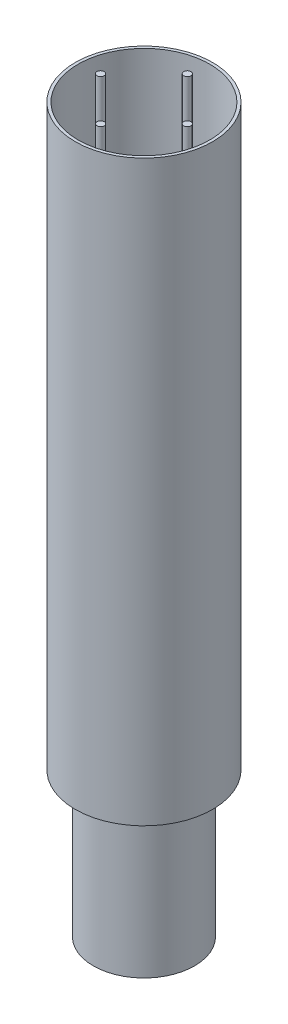
ISO-10303-21;
HEADER;
FILE_DESCRIPTION(('STEP AP214'),'2;1');
FILE_NAME('part.step','',(''),(''),'','','');
FILE_SCHEMA(('AUTOMOTIVE_DESIGN { 1 0 10303 214 1 1 1 1 }'));
ENDSEC;
DATA;
#1=APPLICATION_CONTEXT('core data for automotive mechanical design processes');
#2=APPLICATION_PROTOCOL_DEFINITION('international standard','automotive_design',2000,#1);
#3=PRODUCT_CONTEXT('',#1,'mechanical');
#4=PRODUCT('Part','Part','',(#3));
#5=PRODUCT_RELATED_PRODUCT_CATEGORY('part','',(#4));
#6=PRODUCT_DEFINITION_FORMATION('','',#4);
#7=PRODUCT_DEFINITION_CONTEXT('part definition',#1,'design');
#8=PRODUCT_DEFINITION('design','',#6,#7);
#9=PRODUCT_DEFINITION_SHAPE('','',#8);
#10=(LENGTH_UNIT() NAMED_UNIT(*) SI_UNIT(.MILLI.,.METRE.));
#11=(NAMED_UNIT(*) PLANE_ANGLE_UNIT() SI_UNIT($,.RADIAN.));
#12=(NAMED_UNIT(*) SI_UNIT($,.STERADIAN.) SOLID_ANGLE_UNIT());
#13=UNCERTAINTY_MEASURE_WITH_UNIT(LENGTH_MEASURE(1.E-05),#10,'distance_accuracy_value','');
#14=(GEOMETRIC_REPRESENTATION_CONTEXT(3) GLOBAL_UNCERTAINTY_ASSIGNED_CONTEXT((#13)) GLOBAL_UNIT_ASSIGNED_CONTEXT((#10,
#11,#12)) REPRESENTATION_CONTEXT('',''));
#15=CARTESIAN_POINT('',(0.,0.,0.));
#16=DIRECTION('',(0.,0.,1.));
#17=DIRECTION('',(1.,0.,0.));
#18=AXIS2_PLACEMENT_3D('',#15,#16,#17);
#19=CARTESIAN_POINT('',(0.,502.,30.));
#20=DIRECTION('',(0.,-1.,0.));
#21=DIRECTION('',(0.,0.,-1.));
#22=AXIS2_PLACEMENT_3D('',#19,#20,#21);
#23=CYLINDRICAL_SURFACE('',#22,2.5);
#24=CARTESIAN_POINT('',(0.,502.,30.));
#25=DIRECTION('',(0.,1.,0.));
#26=DIRECTION('',(0.,0.,1.));
#27=AXIS2_PLACEMENT_3D('',#24,#25,#26);
#28=CIRCLE('',#27,2.5);
#29=CARTESIAN_POINT('',(0.,502.,32.5));
#30=VERTEX_POINT('',#29);
#31=EDGE_CURVE('E47',#30,#30,#28,.T.);
#32=ORIENTED_EDGE('',*,*,#31,.F.);
#33=EDGE_LOOP('',(#32));
#34=FACE_BOUND('',#33,.T.);
#35=CARTESIAN_POINT('',(0.,102.,30.));
#36=DIRECTION('',(0.,1.,0.));
#37=DIRECTION('',(0.,0.,1.));
#38=AXIS2_PLACEMENT_3D('',#35,#36,#37);
#39=CIRCLE('',#38,2.5);
#40=CARTESIAN_POINT('',(0.,102.,32.5));
#41=VERTEX_POINT('',#40);
#42=EDGE_CURVE('E11',#41,#41,#39,.T.);
#43=ORIENTED_EDGE('',*,*,#42,.T.);
#44=EDGE_LOOP('',(#43));
#45=FACE_BOUND('',#44,.T.);
#46=ADVANCED_FACE('F43',(#34,#45),#23,.T.);
#47=CARTESIAN_POINT('',(0.,502.,30.));
#48=DIRECTION('',(0.,1.,0.));
#49=DIRECTION('',(0.,0.,1.));
#50=AXIS2_PLACEMENT_3D('',#47,#48,#49);
#51=PLANE('',#50);
#52=ORIENTED_EDGE('',*,*,#31,.T.);
#53=EDGE_LOOP('',(#52));
#54=FACE_BOUND('',#53,.T.);
#55=ADVANCED_FACE('F45',(#54),#51,.T.);
#56=CARTESIAN_POINT('',(0.,102.,30.));
#57=DIRECTION('',(0.,1.,0.));
#58=DIRECTION('',(0.,0.,1.));
#59=AXIS2_PLACEMENT_3D('',#56,#57,#58);
#60=PLANE('',#59);
#61=ORIENTED_EDGE('',*,*,#42,.F.);
#62=EDGE_LOOP('',(#61));
#63=FACE_BOUND('',#62,.T.);
#64=ADVANCED_FACE('F62',(#63),#60,.F.);
#65=CLOSED_SHELL('',(#46,#55,#64));
#66=MANIFOLD_SOLID_BREP('B2',#65);
#67=CARTESIAN_POINT('',(30.,502.,0.));
#68=DIRECTION('',(0.,-1.,0.));
#69=DIRECTION('',(0.,0.,-1.));
#70=AXIS2_PLACEMENT_3D('',#67,#68,#69);
#71=CYLINDRICAL_SURFACE('',#70,2.5);
#72=CARTESIAN_POINT('',(30.,502.,0.));
#73=DIRECTION('',(0.,1.,0.));
#74=DIRECTION('',(0.,0.,1.));
#75=AXIS2_PLACEMENT_3D('',#72,#73,#74);
#76=CIRCLE('',#75,2.5);
#77=CARTESIAN_POINT('',(30.,502.,2.5));
#78=VERTEX_POINT('',#77);
#79=EDGE_CURVE('E101',#78,#78,#76,.T.);
#80=ORIENTED_EDGE('',*,*,#79,.F.);
#81=EDGE_LOOP('',(#80));
#82=FACE_BOUND('',#81,.T.);
#83=CARTESIAN_POINT('',(30.,102.,0.));
#84=DIRECTION('',(0.,1.,0.));
#85=DIRECTION('',(0.,0.,1.));
#86=AXIS2_PLACEMENT_3D('',#83,#84,#85);
#87=CIRCLE('',#86,2.5);
#88=CARTESIAN_POINT('',(30.,102.,2.5));
#89=VERTEX_POINT('',#88);
#90=EDGE_CURVE('E42',#89,#89,#87,.T.);
#91=ORIENTED_EDGE('',*,*,#90,.T.);
#92=EDGE_LOOP('',(#91));
#93=FACE_BOUND('',#92,.T.);
#94=ADVANCED_FACE('F97',(#82,#93),#71,.T.);
#95=CARTESIAN_POINT('',(30.,502.,0.));
#96=DIRECTION('',(0.,1.,0.));
#97=DIRECTION('',(0.,0.,1.));
#98=AXIS2_PLACEMENT_3D('',#95,#96,#97);
#99=PLANE('',#98);
#100=ORIENTED_EDGE('',*,*,#79,.T.);
#101=EDGE_LOOP('',(#100));
#102=FACE_BOUND('',#101,.T.);
#103=ADVANCED_FACE('F99',(#102),#99,.T.);
#104=CARTESIAN_POINT('',(30.,102.,0.));
#105=DIRECTION('',(0.,1.,0.));
#106=DIRECTION('',(0.,0.,1.));
#107=AXIS2_PLACEMENT_3D('',#104,#105,#106);
#108=PLANE('',#107);
#109=ORIENTED_EDGE('',*,*,#90,.F.);
#110=EDGE_LOOP('',(#109));
#111=FACE_BOUND('',#110,.T.);
#112=ADVANCED_FACE('F116',(#111),#108,.F.);
#113=CLOSED_SHELL('',(#94,#103,#112));
#114=MANIFOLD_SOLID_BREP('B6',#113);
#115=CARTESIAN_POINT('',(0.,502.,-30.));
#116=DIRECTION('',(0.,-1.,0.));
#117=DIRECTION('',(0.,0.,-1.));
#118=AXIS2_PLACEMENT_3D('',#115,#116,#117);
#119=CYLINDRICAL_SURFACE('',#118,2.5);
#120=CARTESIAN_POINT('',(0.,502.,-30.));
#121=DIRECTION('',(0.,1.,0.));
#122=DIRECTION('',(0.,0.,1.));
#123=AXIS2_PLACEMENT_3D('',#120,#121,#122);
#124=CIRCLE('',#123,2.5);
#125=CARTESIAN_POINT('',(0.,502.,-27.5));
#126=VERTEX_POINT('',#125);
#127=EDGE_CURVE('E155',#126,#126,#124,.T.);
#128=ORIENTED_EDGE('',*,*,#127,.F.);
#129=EDGE_LOOP('',(#128));
#130=FACE_BOUND('',#129,.T.);
#131=CARTESIAN_POINT('',(0.,102.,-30.));
#132=DIRECTION('',(0.,1.,0.));
#133=DIRECTION('',(0.,0.,1.));
#134=AXIS2_PLACEMENT_3D('',#131,#132,#133);
#135=CIRCLE('',#134,2.5);
#136=CARTESIAN_POINT('',(0.,102.,-27.5));
#137=VERTEX_POINT('',#136);
#138=EDGE_CURVE('E96',#137,#137,#135,.T.);
#139=ORIENTED_EDGE('',*,*,#138,.T.);
#140=EDGE_LOOP('',(#139));
#141=FACE_BOUND('',#140,.T.);
#142=ADVANCED_FACE('F151',(#130,#141),#119,.T.);
#143=CARTESIAN_POINT('',(0.,502.,-30.));
#144=DIRECTION('',(0.,1.,0.));
#145=DIRECTION('',(0.,0.,1.));
#146=AXIS2_PLACEMENT_3D('',#143,#144,#145);
#147=PLANE('',#146);
#148=ORIENTED_EDGE('',*,*,#127,.T.);
#149=EDGE_LOOP('',(#148));
#150=FACE_BOUND('',#149,.T.);
#151=ADVANCED_FACE('F153',(#150),#147,.T.);
#152=CARTESIAN_POINT('',(0.,102.,-30.));
#153=DIRECTION('',(0.,1.,0.));
#154=DIRECTION('',(0.,0.,1.));
#155=AXIS2_PLACEMENT_3D('',#152,#153,#154);
#156=PLANE('',#155);
#157=ORIENTED_EDGE('',*,*,#138,.F.);
#158=EDGE_LOOP('',(#157));
#159=FACE_BOUND('',#158,.T.);
#160=ADVANCED_FACE('F170',(#159),#156,.F.);
#161=CLOSED_SHELL('',(#142,#151,#160));
#162=MANIFOLD_SOLID_BREP('B37',#161);
#163=CARTESIAN_POINT('',(-30.,502.,0.));
#164=DIRECTION('',(0.,-1.,0.));
#165=DIRECTION('',(0.,0.,-1.));
#166=AXIS2_PLACEMENT_3D('',#163,#164,#165);
#167=CYLINDRICAL_SURFACE('',#166,2.5);
#168=CARTESIAN_POINT('',(-30.,502.,0.));
#169=DIRECTION('',(0.,1.,0.));
#170=DIRECTION('',(0.,0.,1.));
#171=AXIS2_PLACEMENT_3D('',#168,#169,#170);
#172=CIRCLE('',#171,2.5);
#173=CARTESIAN_POINT('',(-30.,502.,2.5));
#174=VERTEX_POINT('',#173);
#175=EDGE_CURVE('E150',#174,#174,#172,.T.);
#176=ORIENTED_EDGE('',*,*,#175,.F.);
#177=EDGE_LOOP('',(#176));
#178=FACE_BOUND('',#177,.T.);
#179=CARTESIAN_POINT('',(-30.,102.,0.));
#180=DIRECTION('',(0.,1.,0.));
#181=DIRECTION('',(0.,0.,1.));
#182=AXIS2_PLACEMENT_3D('',#179,#180,#181);
#183=CIRCLE('',#182,2.5);
#184=CARTESIAN_POINT('',(-30.,102.,2.5));
#185=VERTEX_POINT('',#184);
#186=EDGE_CURVE('E207',#185,#185,#183,.T.);
#187=ORIENTED_EDGE('',*,*,#186,.T.);
#188=EDGE_LOOP('',(#187));
#189=FACE_BOUND('',#188,.T.);
#190=ADVANCED_FACE('F204',(#178,#189),#167,.T.);
#191=CARTESIAN_POINT('',(-30.,502.,0.));
#192=DIRECTION('',(0.,1.,0.));
#193=DIRECTION('',(0.,0.,1.));
#194=AXIS2_PLACEMENT_3D('',#191,#192,#193);
#195=PLANE('',#194);
#196=ORIENTED_EDGE('',*,*,#175,.T.);
#197=EDGE_LOOP('',(#196));
#198=FACE_BOUND('',#197,.T.);
#199=ADVANCED_FACE('F219',(#198),#195,.T.);
#200=CARTESIAN_POINT('',(-30.,102.,0.));
#201=DIRECTION('',(0.,1.,0.));
#202=DIRECTION('',(0.,0.,1.));
#203=AXIS2_PLACEMENT_3D('',#200,#201,#202);
#204=PLANE('',#203);
#205=ORIENTED_EDGE('',*,*,#186,.F.);
#206=EDGE_LOOP('',(#205));
#207=FACE_BOUND('',#206,.T.);
#208=ADVANCED_FACE('F217',(#207),#204,.F.);
#209=CLOSED_SHELL('',(#190,#199,#208));
#210=MANIFOLD_SOLID_BREP('B91',#209);
#211=CARTESIAN_POINT('',(0.,100.,0.));
#212=DIRECTION('',(0.,-1.,0.));
#213=DIRECTION('',(0.,0.,-1.));
#214=AXIS2_PLACEMENT_3D('',#211,#212,#213);
#215=CYLINDRICAL_SURFACE('',#214,35.);
#216=CARTESIAN_POINT('',(0.,100.,0.));
#217=DIRECTION('',(0.,1.,0.));
#218=DIRECTION('',(0.,0.,1.));
#219=AXIS2_PLACEMENT_3D('',#216,#217,#218);
#220=CIRCLE('',#219,35.);
#221=CARTESIAN_POINT('',(0.,100.,35.));
#222=VERTEX_POINT('',#221);
#223=EDGE_CURVE('E203',#222,#222,#220,.T.);
#224=ORIENTED_EDGE('',*,*,#223,.F.);
#225=EDGE_LOOP('',(#224));
#226=FACE_BOUND('',#225,.T.);
#227=CARTESIAN_POINT('',(0.,0.,0.));
#228=DIRECTION('',(0.,1.,0.));
#229=DIRECTION('',(0.,0.,1.));
#230=AXIS2_PLACEMENT_3D('',#227,#228,#229);
#231=CIRCLE('',#230,35.);
#232=CARTESIAN_POINT('',(0.,0.,35.));
#233=VERTEX_POINT('',#232);
#234=EDGE_CURVE('E253',#233,#233,#231,.T.);
#235=ORIENTED_EDGE('',*,*,#234,.T.);
#236=EDGE_LOOP('',(#235));
#237=FACE_BOUND('',#236,.T.);
#238=ADVANCED_FACE('F250',(#226,#237),#215,.T.);
#239=CARTESIAN_POINT('',(0.,0.,0.));
#240=DIRECTION('',(0.,1.,0.));
#241=DIRECTION('',(0.,0.,1.));
#242=AXIS2_PLACEMENT_3D('',#239,#240,#241);
#243=PLANE('',#242);
#244=ORIENTED_EDGE('',*,*,#234,.F.);
#245=EDGE_LOOP('',(#244));
#246=FACE_BOUND('',#245,.T.);
#247=ADVANCED_FACE('F300',(#246),#243,.F.);
#248=CARTESIAN_POINT('',(0.,500.,0.));
#249=DIRECTION('',(0.,-1.,0.));
#250=DIRECTION('',(0.,0.,-1.));
#251=AXIS2_PLACEMENT_3D('',#248,#249,#250);
#252=CYLINDRICAL_SURFACE('',#251,47.5000000000001);
#253=CARTESIAN_POINT('',(0.,500.,0.));
#254=DIRECTION('',(0.,1.,0.));
#255=DIRECTION('',(0.,0.,1.));
#256=AXIS2_PLACEMENT_3D('',#253,#254,#255);
#257=CIRCLE('',#256,47.5000000000001);
#258=CARTESIAN_POINT('',(0.,500.,47.5000000000001));
#259=VERTEX_POINT('',#258);
#260=EDGE_CURVE('E260',#259,#259,#257,.T.);
#261=ORIENTED_EDGE('',*,*,#260,.F.);
#262=EDGE_LOOP('',(#261));
#263=FACE_BOUND('',#262,.T.);
#264=CARTESIAN_POINT('',(0.,100.,0.));
#265=DIRECTION('',(0.,1.,0.));
#266=DIRECTION('',(0.,0.,1.));
#267=AXIS2_PLACEMENT_3D('',#264,#265,#266);
#268=CIRCLE('',#267,47.5000000000001);
#269=CARTESIAN_POINT('',(0.,100.,47.5000000000001));
#270=VERTEX_POINT('',#269);
#271=EDGE_CURVE('E262',#270,#270,#268,.T.);
#272=ORIENTED_EDGE('',*,*,#271,.T.);
#273=EDGE_LOOP('',(#272));
#274=FACE_BOUND('',#273,.T.);
#275=ADVANCED_FACE('F305',(#263,#274),#252,.T.);
#276=CARTESIAN_POINT('',(0.,500.,0.));
#277=DIRECTION('',(0.,1.,0.));
#278=DIRECTION('',(0.,0.,1.));
#279=AXIS2_PLACEMENT_3D('',#276,#277,#278);
#280=PLANE('',#279);
#281=CARTESIAN_POINT('',(0.,500.,0.));
#282=DIRECTION('',(0.,1.,0.));
#283=DIRECTION('',(0.,0.,1.));
#284=AXIS2_PLACEMENT_3D('',#281,#282,#283);
#285=CIRCLE('',#284,45.5000000000001);
#286=CARTESIAN_POINT('',(0.,500.,45.5000000000001));
#287=VERTEX_POINT('',#286);
#288=EDGE_CURVE('E268',#287,#287,#285,.T.);
#289=ORIENTED_EDGE('',*,*,#288,.F.);
#290=EDGE_LOOP('',(#289));
#291=FACE_BOUND('',#290,.T.);
#292=ORIENTED_EDGE('',*,*,#260,.T.);
#293=EDGE_LOOP('',(#292));
#294=FACE_BOUND('',#293,.T.);
#295=ADVANCED_FACE('F312',(#291,#294),#280,.T.);
#296=CARTESIAN_POINT('',(0.,100.,0.));
#297=DIRECTION('',(0.,1.,0.));
#298=DIRECTION('',(0.,0.,1.));
#299=AXIS2_PLACEMENT_3D('',#296,#297,#298);
#300=PLANE('',#299);
#301=ORIENTED_EDGE('',*,*,#223,.T.);
#302=EDGE_LOOP('',(#301));
#303=FACE_BOUND('',#302,.T.);
#304=ORIENTED_EDGE('',*,*,#271,.F.);
#305=EDGE_LOOP('',(#304));
#306=FACE_BOUND('',#305,.T.);
#307=ADVANCED_FACE('F316',(#303,#306),#300,.F.);
#308=CARTESIAN_POINT('',(0.,100.,0.));
#309=DIRECTION('',(0.,-1.,0.));
#310=DIRECTION('',(0.,0.,-1.));
#311=AXIS2_PLACEMENT_3D('',#308,#309,#310);
#312=CYLINDRICAL_SURFACE('',#311,33.);
#313=CARTESIAN_POINT('',(0.,102.,0.));
#314=DIRECTION('',(0.,1.,0.));
#315=DIRECTION('',(0.,0.,1.));
#316=AXIS2_PLACEMENT_3D('',#313,#314,#315);
#317=CIRCLE('',#316,33.);
#318=CARTESIAN_POINT('',(0.,102.,33.));
#319=VERTEX_POINT('',#318);
#320=EDGE_CURVE('E265',#319,#319,#317,.T.);
#321=ORIENTED_EDGE('',*,*,#320,.T.);
#322=EDGE_LOOP('',(#321));
#323=FACE_BOUND('',#322,.T.);
#324=CARTESIAN_POINT('',(0.,2.,0.));
#325=DIRECTION('',(0.,1.,0.));
#326=DIRECTION('',(0.,0.,1.));
#327=AXIS2_PLACEMENT_3D('',#324,#325,#326);
#328=CIRCLE('',#327,33.);
#329=CARTESIAN_POINT('',(0.,2.,33.));
#330=VERTEX_POINT('',#329);
#331=EDGE_CURVE('E271',#330,#330,#328,.T.);
#332=ORIENTED_EDGE('',*,*,#331,.F.);
#333=EDGE_LOOP('',(#332));
#334=FACE_BOUND('',#333,.T.);
#335=ADVANCED_FACE('F280',(#323,#334),#312,.F.);
#336=CARTESIAN_POINT('',(0.,2.,0.));
#337=DIRECTION('',(0.,1.,0.));
#338=DIRECTION('',(0.,0.,1.));
#339=AXIS2_PLACEMENT_3D('',#336,#337,#338);
#340=PLANE('',#339);
#341=ORIENTED_EDGE('',*,*,#331,.T.);
#342=EDGE_LOOP('',(#341));
#343=FACE_BOUND('',#342,.T.);
#344=ADVANCED_FACE('F291',(#343),#340,.T.);
#345=CARTESIAN_POINT('',(0.,500.,0.));
#346=DIRECTION('',(0.,-1.,0.));
#347=DIRECTION('',(0.,0.,-1.));
#348=AXIS2_PLACEMENT_3D('',#345,#346,#347);
#349=CYLINDRICAL_SURFACE('',#348,45.5000000000001);
#350=ORIENTED_EDGE('',*,*,#288,.T.);
#351=EDGE_LOOP('',(#350));
#352=FACE_BOUND('',#351,.T.);
#353=CARTESIAN_POINT('',(0.,102.,0.));
#354=DIRECTION('',(0.,1.,0.));
#355=DIRECTION('',(0.,0.,1.));
#356=AXIS2_PLACEMENT_3D('',#353,#354,#355);
#357=CIRCLE('',#356,45.5000000000001);
#358=CARTESIAN_POINT('',(0.,102.,45.5000000000001));
#359=VERTEX_POINT('',#358);
#360=EDGE_CURVE('E272',#359,#359,#357,.T.);
#361=ORIENTED_EDGE('',*,*,#360,.F.);
#362=EDGE_LOOP('',(#361));
#363=FACE_BOUND('',#362,.T.);
#364=ADVANCED_FACE('F286',(#352,#363),#349,.F.);
#365=CARTESIAN_POINT('',(0.,102.,0.));
#366=DIRECTION('',(0.,1.,0.));
#367=DIRECTION('',(0.,0.,1.));
#368=AXIS2_PLACEMENT_3D('',#365,#366,#367);
#369=PLANE('',#368);
#370=ORIENTED_EDGE('',*,*,#320,.F.);
#371=EDGE_LOOP('',(#370));
#372=FACE_BOUND('',#371,.T.);
#373=ORIENTED_EDGE('',*,*,#360,.T.);
#374=EDGE_LOOP('',(#373));
#375=FACE_BOUND('',#374,.T.);
#376=ADVANCED_FACE('F283',(#372,#375),#369,.T.);
#377=CLOSED_SHELL('',(#238,#247,#275,#295,#307,#335,#344,#364,#376));
#378=MANIFOLD_SOLID_BREP('B145',#377);
#379=ADVANCED_BREP_SHAPE_REPRESENTATION('',(#18,#66,#114,#162,#210,#378),#14);
#380=SHAPE_DEFINITION_REPRESENTATION(#9,#379);
ENDSEC;
END-ISO-10303-21;
